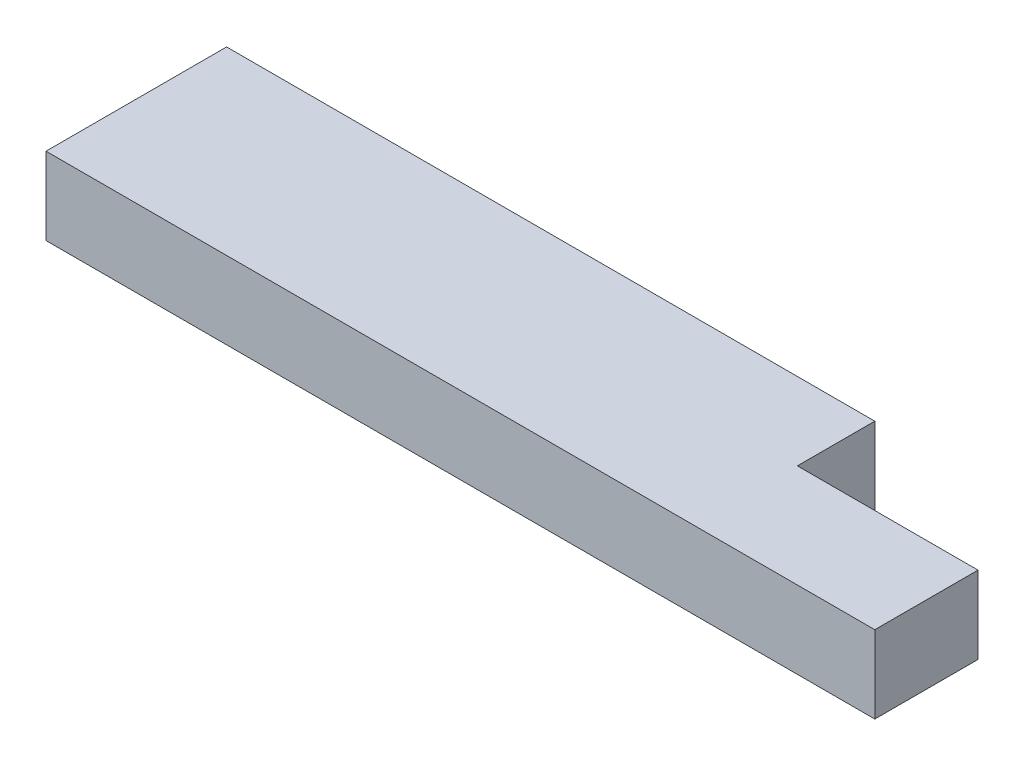
ISO-10303-21;
HEADER;
FILE_DESCRIPTION(('STEP AP214'),'2;1');
FILE_NAME('part.step','',(''),(''),'','','');
FILE_SCHEMA(('AUTOMOTIVE_DESIGN { 1 0 10303 214 1 1 1 1 }'));
ENDSEC;
DATA;
#1=APPLICATION_CONTEXT('core data for automotive mechanical design processes');
#2=APPLICATION_PROTOCOL_DEFINITION('international standard','automotive_design',2000,#1);
#3=PRODUCT_CONTEXT('',#1,'mechanical');
#4=PRODUCT('Part','Part','',(#3));
#5=PRODUCT_RELATED_PRODUCT_CATEGORY('part','',(#4));
#6=PRODUCT_DEFINITION_FORMATION('','',#4);
#7=PRODUCT_DEFINITION_CONTEXT('part definition',#1,'design');
#8=PRODUCT_DEFINITION('design','',#6,#7);
#9=PRODUCT_DEFINITION_SHAPE('','',#8);
#10=(LENGTH_UNIT() NAMED_UNIT(*) SI_UNIT(.MILLI.,.METRE.));
#11=(NAMED_UNIT(*) PLANE_ANGLE_UNIT() SI_UNIT($,.RADIAN.));
#12=(NAMED_UNIT(*) SI_UNIT($,.STERADIAN.) SOLID_ANGLE_UNIT());
#13=UNCERTAINTY_MEASURE_WITH_UNIT(LENGTH_MEASURE(1.E-05),#10,'distance_accuracy_value','');
#14=(GEOMETRIC_REPRESENTATION_CONTEXT(3) GLOBAL_UNCERTAINTY_ASSIGNED_CONTEXT((#13)) GLOBAL_UNIT_ASSIGNED_CONTEXT((#10,
#11,#12)) REPRESENTATION_CONTEXT('',''));
#15=CARTESIAN_POINT('',(0.,0.,0.));
#16=DIRECTION('',(0.,0.,1.));
#17=DIRECTION('',(1.,0.,0.));
#18=AXIS2_PLACEMENT_3D('',#15,#16,#17);
#19=CARTESIAN_POINT('',(0.,38.1,0.));
#20=DIRECTION('',(1.,0.,0.));
#21=DIRECTION('',(0.,0.,-1.));
#22=AXIS2_PLACEMENT_3D('',#19,#20,#21);
#23=PLANE('',#22);
#24=DIRECTION('',(0.,0.,1.));
#25=VECTOR('',#24,1.);
#26=CARTESIAN_POINT('',(0.,0.,0.));
#27=LINE('',#26,#25);
#28=CARTESIAN_POINT('',(0.,0.,-88.9));
#29=VERTEX_POINT('',#28);
#30=CARTESIAN_POINT('',(0.,0.,0.));
#31=VERTEX_POINT('',#30);
#32=EDGE_CURVE('E123',#29,#31,#27,.T.);
#33=ORIENTED_EDGE('',*,*,#32,.T.);
#34=DIRECTION('',(0.,-1.,0.));
#35=VECTOR('',#34,1.);
#36=CARTESIAN_POINT('',(0.,38.1,0.));
#37=LINE('',#36,#35);
#38=CARTESIAN_POINT('',(0.,38.1,0.));
#39=VERTEX_POINT('',#38);
#40=EDGE_CURVE('E11',#39,#31,#37,.T.);
#41=ORIENTED_EDGE('',*,*,#40,.F.);
#42=DIRECTION('',(0.,0.,1.));
#43=VECTOR('',#42,1.);
#44=CARTESIAN_POINT('',(0.,38.1,0.));
#45=LINE('',#44,#43);
#46=CARTESIAN_POINT('',(0.,38.1,-88.9));
#47=VERTEX_POINT('',#46);
#48=EDGE_CURVE('E119',#47,#39,#45,.T.);
#49=ORIENTED_EDGE('',*,*,#48,.F.);
#50=DIRECTION('',(0.,-1.,0.));
#51=VECTOR('',#50,1.);
#52=CARTESIAN_POINT('',(0.,38.1,-88.9));
#53=LINE('',#52,#51);
#54=EDGE_CURVE('E117',#47,#29,#53,.T.);
#55=ORIENTED_EDGE('',*,*,#54,.T.);
#56=EDGE_LOOP('',(#33,#41,#49,#55));
#57=FACE_BOUND('',#56,.T.);
#58=ADVANCED_FACE('F39',(#57),#23,.F.);
#59=CARTESIAN_POINT('',(0.,38.1,0.));
#60=DIRECTION('',(0.,0.,-1.));
#61=DIRECTION('',(-1.,0.,0.));
#62=AXIS2_PLACEMENT_3D('',#59,#60,#61);
#63=PLANE('',#62);
#64=DIRECTION('',(1.,0.,0.));
#65=VECTOR('',#64,1.);
#66=CARTESIAN_POINT('',(0.,0.,0.));
#67=LINE('',#66,#65);
#68=CARTESIAN_POINT('',(407.987500000005,0.,-4.20496970576778E-12));
#69=VERTEX_POINT('',#68);
#70=EDGE_CURVE('E126',#31,#69,#67,.T.);
#71=ORIENTED_EDGE('',*,*,#70,.T.);
#72=DIRECTION('',(0.,-1.,0.));
#73=VECTOR('',#72,1.);
#74=CARTESIAN_POINT('',(407.987500000005,38.1,-4.20496970576778E-12));
#75=LINE('',#74,#73);
#76=CARTESIAN_POINT('',(407.987500000005,38.1,-4.20496970576778E-12));
#77=VERTEX_POINT('',#76);
#78=EDGE_CURVE('E127',#77,#69,#75,.T.);
#79=ORIENTED_EDGE('',*,*,#78,.F.);
#80=DIRECTION('',(1.,0.,0.));
#81=VECTOR('',#80,1.);
#82=CARTESIAN_POINT('',(0.,38.1,0.));
#83=LINE('',#82,#81);
#84=EDGE_CURVE('E85',#39,#77,#83,.T.);
#85=ORIENTED_EDGE('',*,*,#84,.F.);
#86=ORIENTED_EDGE('',*,*,#40,.T.);
#87=EDGE_LOOP('',(#71,#79,#85,#86));
#88=FACE_BOUND('',#87,.T.);
#89=ADVANCED_FACE('F149',(#88),#63,.F.);
#90=CARTESIAN_POINT('',(319.0875,38.1,0.));
#91=DIRECTION('',(-1.,0.,0.));
#92=DIRECTION('',(0.,0.,1.));
#93=AXIS2_PLACEMENT_3D('',#90,#91,#92);
#94=PLANE('',#93);
#95=DIRECTION('',(0.,0.,-1.));
#96=VECTOR('',#95,1.);
#97=CARTESIAN_POINT('',(319.0875,38.1,0.));
#98=LINE('',#97,#96);
#99=CARTESIAN_POINT('',(319.0875,38.1,-50.8000000000211));
#100=VERTEX_POINT('',#99);
#101=CARTESIAN_POINT('',(319.0875,38.1,-88.9));
#102=VERTEX_POINT('',#101);
#103=EDGE_CURVE('E110',#100,#102,#98,.T.);
#104=ORIENTED_EDGE('',*,*,#103,.F.);
#105=DIRECTION('',(0.,-1.,0.));
#106=VECTOR('',#105,1.);
#107=CARTESIAN_POINT('',(319.0875,38.1,-50.8000000000211));
#108=LINE('',#107,#106);
#109=CARTESIAN_POINT('',(319.0875,0.,-50.8000000000211));
#110=VERTEX_POINT('',#109);
#111=EDGE_CURVE('E98',#100,#110,#108,.T.);
#112=ORIENTED_EDGE('',*,*,#111,.T.);
#113=DIRECTION('',(0.,0.,-1.));
#114=VECTOR('',#113,1.);
#115=CARTESIAN_POINT('',(319.0875,0.,0.));
#116=LINE('',#115,#114);
#117=CARTESIAN_POINT('',(319.0875,0.,-88.9));
#118=VERTEX_POINT('',#117);
#119=EDGE_CURVE('E129',#110,#118,#116,.T.);
#120=ORIENTED_EDGE('',*,*,#119,.T.);
#121=DIRECTION('',(0.,-1.,0.));
#122=VECTOR('',#121,1.);
#123=CARTESIAN_POINT('',(319.0875,38.1,-88.9));
#124=LINE('',#123,#122);
#125=EDGE_CURVE('E46',#102,#118,#124,.T.);
#126=ORIENTED_EDGE('',*,*,#125,.F.);
#127=EDGE_LOOP('',(#104,#112,#120,#126));
#128=FACE_BOUND('',#127,.T.);
#129=ADVANCED_FACE('F115',(#128),#94,.F.);
#130=CARTESIAN_POINT('',(0.,38.1,-88.9));
#131=DIRECTION('',(0.,0.,1.));
#132=DIRECTION('',(1.,0.,0.));
#133=AXIS2_PLACEMENT_3D('',#130,#131,#132);
#134=PLANE('',#133);
#135=DIRECTION('',(-1.,0.,0.));
#136=VECTOR('',#135,1.);
#137=CARTESIAN_POINT('',(0.,0.,-88.9));
#138=LINE('',#137,#136);
#139=EDGE_CURVE('E79',#118,#29,#138,.T.);
#140=ORIENTED_EDGE('',*,*,#139,.T.);
#141=ORIENTED_EDGE('',*,*,#54,.F.);
#142=DIRECTION('',(-1.,0.,0.));
#143=VECTOR('',#142,1.);
#144=CARTESIAN_POINT('',(0.,38.1,-88.9));
#145=LINE('',#144,#143);
#146=EDGE_CURVE('E62',#102,#47,#145,.T.);
#147=ORIENTED_EDGE('',*,*,#146,.F.);
#148=ORIENTED_EDGE('',*,*,#125,.T.);
#149=EDGE_LOOP('',(#140,#141,#147,#148));
#150=FACE_BOUND('',#149,.T.);
#151=ADVANCED_FACE('F132',(#150),#134,.F.);
#152=CARTESIAN_POINT('',(0.,38.1,0.));
#153=DIRECTION('',(0.,-1.,0.));
#154=DIRECTION('',(0.,0.,-1.));
#155=AXIS2_PLACEMENT_3D('',#152,#153,#154);
#156=PLANE('',#155);
#157=ORIENTED_EDGE('',*,*,#48,.T.);
#158=ORIENTED_EDGE('',*,*,#84,.T.);
#159=DIRECTION('',(0.,0.,1.));
#160=VECTOR('',#159,1.);
#161=CARTESIAN_POINT('',(407.987500000005,38.1,-50.8000000000211));
#162=LINE('',#161,#160);
#163=CARTESIAN_POINT('',(407.987500000005,38.1,-50.8000000000211));
#164=VERTEX_POINT('',#163);
#165=EDGE_CURVE('E106',#164,#77,#162,.T.);
#166=ORIENTED_EDGE('',*,*,#165,.F.);
#167=DIRECTION('',(1.,0.,0.));
#168=VECTOR('',#167,1.);
#169=CARTESIAN_POINT('',(319.0875,38.1,-50.8000000000211));
#170=LINE('',#169,#168);
#171=EDGE_CURVE('E101',#100,#164,#170,.T.);
#172=ORIENTED_EDGE('',*,*,#171,.F.);
#173=ORIENTED_EDGE('',*,*,#103,.T.);
#174=ORIENTED_EDGE('',*,*,#146,.T.);
#175=EDGE_LOOP('',(#157,#158,#166,#172,#173,#174));
#176=FACE_BOUND('',#175,.T.);
#177=ADVANCED_FACE('F109',(#176),#156,.F.);
#178=CARTESIAN_POINT('',(0.,0.,0.));
#179=DIRECTION('',(0.,-1.,0.));
#180=DIRECTION('',(0.,0.,-1.));
#181=AXIS2_PLACEMENT_3D('',#178,#179,#180);
#182=PLANE('',#181);
#183=ORIENTED_EDGE('',*,*,#32,.F.);
#184=ORIENTED_EDGE('',*,*,#139,.F.);
#185=ORIENTED_EDGE('',*,*,#119,.F.);
#186=DIRECTION('',(1.,0.,0.));
#187=VECTOR('',#186,1.);
#188=CARTESIAN_POINT('',(319.0875,0.,-50.8000000000211));
#189=LINE('',#188,#187);
#190=CARTESIAN_POINT('',(407.987500000005,0.,-50.8000000000211));
#191=VERTEX_POINT('',#190);
#192=EDGE_CURVE('E53',#110,#191,#189,.T.);
#193=ORIENTED_EDGE('',*,*,#192,.T.);
#194=DIRECTION('',(0.,0.,1.));
#195=VECTOR('',#194,1.);
#196=CARTESIAN_POINT('',(407.987500000005,0.,-50.8000000000211));
#197=LINE('',#196,#195);
#198=EDGE_CURVE('E113',#191,#69,#197,.T.);
#199=ORIENTED_EDGE('',*,*,#198,.T.);
#200=ORIENTED_EDGE('',*,*,#70,.F.);
#201=EDGE_LOOP('',(#183,#184,#185,#193,#199,#200));
#202=FACE_BOUND('',#201,.T.);
#203=ADVANCED_FACE('F135',(#202),#182,.T.);
#204=CARTESIAN_POINT('',(407.987500000005,38.1,-50.8000000000211));
#205=DIRECTION('',(1.,0.,0.));
#206=DIRECTION('',(0.,0.,-1.));
#207=AXIS2_PLACEMENT_3D('',#204,#205,#206);
#208=PLANE('',#207);
#209=ORIENTED_EDGE('',*,*,#198,.F.);
#210=DIRECTION('',(0.,-1.,0.));
#211=VECTOR('',#210,1.);
#212=CARTESIAN_POINT('',(407.987500000005,38.1,-50.8000000000211));
#213=LINE('',#212,#211);
#214=EDGE_CURVE('E105',#164,#191,#213,.T.);
#215=ORIENTED_EDGE('',*,*,#214,.F.);
#216=ORIENTED_EDGE('',*,*,#165,.T.);
#217=ORIENTED_EDGE('',*,*,#78,.T.);
#218=EDGE_LOOP('',(#209,#215,#216,#217));
#219=FACE_BOUND('',#218,.T.);
#220=ADVANCED_FACE('F148',(#219),#208,.T.);
#221=CARTESIAN_POINT('',(319.0875,38.1,-50.8000000000211));
#222=DIRECTION('',(0.,0.,-1.));
#223=DIRECTION('',(-1.,0.,0.));
#224=AXIS2_PLACEMENT_3D('',#221,#222,#223);
#225=PLANE('',#224);
#226=ORIENTED_EDGE('',*,*,#192,.F.);
#227=ORIENTED_EDGE('',*,*,#111,.F.);
#228=ORIENTED_EDGE('',*,*,#171,.T.);
#229=ORIENTED_EDGE('',*,*,#214,.T.);
#230=EDGE_LOOP('',(#226,#227,#228,#229));
#231=FACE_BOUND('',#230,.T.);
#232=ADVANCED_FACE('F100',(#231),#225,.T.);
#233=CLOSED_SHELL('',(#58,#89,#129,#151,#177,#203,#220,#232));
#234=MANIFOLD_SOLID_BREP('B2',#233);
#235=ADVANCED_BREP_SHAPE_REPRESENTATION('',(#18,#234),#14);
#236=SHAPE_DEFINITION_REPRESENTATION(#9,#235);
ENDSEC;
END-ISO-10303-21;
